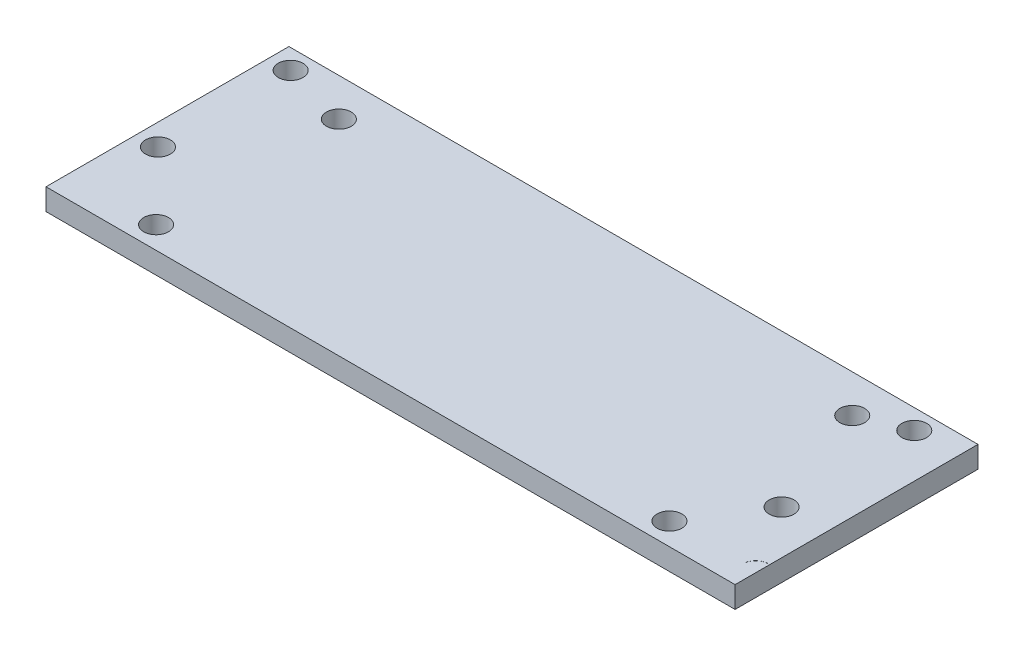
ISO-10303-21;
HEADER;
FILE_DESCRIPTION(('STEP AP214'),'2;1');
FILE_NAME('part.step','',(''),(''),'','','');
FILE_SCHEMA(('AUTOMOTIVE_DESIGN { 1 0 10303 214 1 1 1 1 }'));
ENDSEC;
DATA;
#1=APPLICATION_CONTEXT('core data for automotive mechanical design processes');
#2=APPLICATION_PROTOCOL_DEFINITION('international standard','automotive_design',2000,#1);
#3=PRODUCT_CONTEXT('',#1,'mechanical');
#4=PRODUCT('Part','Part','',(#3));
#5=PRODUCT_RELATED_PRODUCT_CATEGORY('part','',(#4));
#6=PRODUCT_DEFINITION_FORMATION('','',#4);
#7=PRODUCT_DEFINITION_CONTEXT('part definition',#1,'design');
#8=PRODUCT_DEFINITION('design','',#6,#7);
#9=PRODUCT_DEFINITION_SHAPE('','',#8);
#10=(LENGTH_UNIT() NAMED_UNIT(*) SI_UNIT(.MILLI.,.METRE.));
#11=(NAMED_UNIT(*) PLANE_ANGLE_UNIT() SI_UNIT($,.RADIAN.));
#12=(NAMED_UNIT(*) SI_UNIT($,.STERADIAN.) SOLID_ANGLE_UNIT());
#13=UNCERTAINTY_MEASURE_WITH_UNIT(LENGTH_MEASURE(1.E-05),#10,'distance_accuracy_value','');
#14=(GEOMETRIC_REPRESENTATION_CONTEXT(3) GLOBAL_UNCERTAINTY_ASSIGNED_CONTEXT((#13)) GLOBAL_UNIT_ASSIGNED_CONTEXT((#10,
#11,#12)) REPRESENTATION_CONTEXT('',''));
#15=CARTESIAN_POINT('',(0.,0.,0.));
#16=DIRECTION('',(0.,0.,1.));
#17=DIRECTION('',(1.,0.,0.));
#18=AXIS2_PLACEMENT_3D('',#15,#16,#17);
#19=CARTESIAN_POINT('',(-57.15,3.175,17.907));
#20=DIRECTION('',(1.,0.,0.));
#21=DIRECTION('',(0.,0.,-1.));
#22=AXIS2_PLACEMENT_3D('',#19,#20,#21);
#23=PLANE('',#22);
#24=DIRECTION('',(0.,0.,1.));
#25=VECTOR('',#24,1.);
#26=CARTESIAN_POINT('',(-57.15,0.,17.907));
#27=LINE('',#26,#25);
#28=CARTESIAN_POINT('',(-57.15,0.,-17.907));
#29=VERTEX_POINT('',#28);
#30=CARTESIAN_POINT('',(-57.15,0.,17.907));
#31=VERTEX_POINT('',#30);
#32=EDGE_CURVE('E152',#29,#31,#27,.T.);
#33=ORIENTED_EDGE('',*,*,#32,.T.);
#34=DIRECTION('',(0.,-1.,0.));
#35=VECTOR('',#34,1.);
#36=CARTESIAN_POINT('',(-57.15,3.175,17.907));
#37=LINE('',#36,#35);
#38=CARTESIAN_POINT('',(-57.15,3.175,17.907));
#39=VERTEX_POINT('',#38);
#40=EDGE_CURVE('E44',#39,#31,#37,.T.);
#41=ORIENTED_EDGE('',*,*,#40,.F.);
#42=DIRECTION('',(0.,0.,1.));
#43=VECTOR('',#42,1.);
#44=CARTESIAN_POINT('',(-57.15,3.175,17.907));
#45=LINE('',#44,#43);
#46=CARTESIAN_POINT('',(-57.15,3.175,-17.907));
#47=VERTEX_POINT('',#46);
#48=EDGE_CURVE('E155',#47,#39,#45,.T.);
#49=ORIENTED_EDGE('',*,*,#48,.F.);
#50=DIRECTION('',(0.,-1.,0.));
#51=VECTOR('',#50,1.);
#52=CARTESIAN_POINT('',(-57.15,3.175,-17.907));
#53=LINE('',#52,#51);
#54=EDGE_CURVE('E164',#47,#29,#53,.T.);
#55=ORIENTED_EDGE('',*,*,#54,.T.);
#56=EDGE_LOOP('',(#33,#41,#49,#55));
#57=FACE_BOUND('',#56,.T.);
#58=ADVANCED_FACE('F37',(#57),#23,.F.);
#59=CARTESIAN_POINT('',(57.15,3.175,17.907));
#60=DIRECTION('',(0.,0.,-1.));
#61=DIRECTION('',(-1.,0.,0.));
#62=AXIS2_PLACEMENT_3D('',#59,#60,#61);
#63=PLANE('',#62);
#64=DIRECTION('',(1.,0.,0.));
#65=VECTOR('',#64,1.);
#66=CARTESIAN_POINT('',(57.15,0.,17.907));
#67=LINE('',#66,#65);
#68=CARTESIAN_POINT('',(44.45,0.,17.907));
#69=VERTEX_POINT('',#68);
#70=EDGE_CURVE('E167',#31,#69,#67,.T.);
#71=ORIENTED_EDGE('',*,*,#70,.T.);
#72=DIRECTION('',(0.,1.,0.));
#73=VECTOR('',#72,1.);
#74=CARTESIAN_POINT('',(44.45,0.,17.907));
#75=LINE('',#74,#73);
#76=CARTESIAN_POINT('',(44.45,3.175,17.907));
#77=VERTEX_POINT('',#76);
#78=EDGE_CURVE('E90',#69,#77,#75,.T.);
#79=ORIENTED_EDGE('',*,*,#78,.T.);
#80=DIRECTION('',(1.,0.,0.));
#81=VECTOR('',#80,1.);
#82=CARTESIAN_POINT('',(57.15,3.175,17.907));
#83=LINE('',#82,#81);
#84=EDGE_CURVE('E158',#39,#77,#83,.T.);
#85=ORIENTED_EDGE('',*,*,#84,.F.);
#86=ORIENTED_EDGE('',*,*,#40,.T.);
#87=EDGE_LOOP('',(#71,#79,#85,#86));
#88=FACE_BOUND('',#87,.T.);
#89=ADVANCED_FACE('F175',(#88),#63,.F.);
#90=CARTESIAN_POINT('',(57.15,3.175,-17.907));
#91=DIRECTION('',(0.,0.,1.));
#92=DIRECTION('',(1.,0.,0.));
#93=AXIS2_PLACEMENT_3D('',#90,#91,#92);
#94=PLANE('',#93);
#95=DIRECTION('',(-1.,0.,0.));
#96=VECTOR('',#95,1.);
#97=CARTESIAN_POINT('',(57.15,3.175,-17.907));
#98=LINE('',#97,#96);
#99=CARTESIAN_POINT('',(44.45,3.175,-17.907));
#100=VERTEX_POINT('',#99);
#101=EDGE_CURVE('E162',#100,#47,#98,.T.);
#102=ORIENTED_EDGE('',*,*,#101,.F.);
#103=DIRECTION('',(0.,1.,0.));
#104=VECTOR('',#103,1.);
#105=CARTESIAN_POINT('',(44.45,0.,-17.907));
#106=LINE('',#105,#104);
#107=CARTESIAN_POINT('',(44.45,0.,-17.907));
#108=VERTEX_POINT('',#107);
#109=EDGE_CURVE('E123',#108,#100,#106,.T.);
#110=ORIENTED_EDGE('',*,*,#109,.F.);
#111=DIRECTION('',(-1.,0.,0.));
#112=VECTOR('',#111,1.);
#113=CARTESIAN_POINT('',(57.15,0.,-17.907));
#114=LINE('',#113,#112);
#115=EDGE_CURVE('E159',#108,#29,#114,.T.);
#116=ORIENTED_EDGE('',*,*,#115,.T.);
#117=ORIENTED_EDGE('',*,*,#54,.F.);
#118=EDGE_LOOP('',(#102,#110,#116,#117));
#119=FACE_BOUND('',#118,.T.);
#120=ADVANCED_FACE('F191',(#119),#94,.F.);
#121=CARTESIAN_POINT('',(0.,3.175,0.));
#122=DIRECTION('',(0.,1.,0.));
#123=DIRECTION('',(0.,0.,1.));
#124=AXIS2_PLACEMENT_3D('',#121,#122,#123);
#125=PLANE('',#124);
#126=CARTESIAN_POINT('',(37.973,3.175,-14.986));
#127=DIRECTION('',(0.,1.,0.));
#128=DIRECTION('',(0.,0.,1.));
#129=AXIS2_PLACEMENT_3D('',#126,#127,#128);
#130=CIRCLE('',#129,1.8288);
#131=CARTESIAN_POINT('',(37.973,3.175,-13.1572));
#132=VERTEX_POINT('',#131);
#133=EDGE_CURVE('E401',#132,#132,#130,.T.);
#134=ORIENTED_EDGE('',*,*,#133,.F.);
#135=EDGE_LOOP('',(#134));
#136=FACE_BOUND('',#135,.T.);
#137=CARTESIAN_POINT('',(37.973,3.175,4.57200000000001));
#138=DIRECTION('',(0.,1.,0.));
#139=DIRECTION('',(0.,0.,1.));
#140=AXIS2_PLACEMENT_3D('',#137,#138,#139);
#141=CIRCLE('',#140,1.8288);
#142=CARTESIAN_POINT('',(37.973,3.175,6.40080000000001));
#143=VERTEX_POINT('',#142);
#144=EDGE_CURVE('E105',#143,#143,#141,.T.);
#145=ORIENTED_EDGE('',*,*,#144,.F.);
#146=EDGE_LOOP('',(#145));
#147=FACE_BOUND('',#146,.T.);
#148=DIRECTION('',(0.,0.,1.));
#149=VECTOR('',#148,1.);
#150=CARTESIAN_POINT('',(44.45,3.175,17.907));
#151=LINE('',#150,#149);
#152=EDGE_CURVE('E118',#100,#77,#151,.T.);
#153=ORIENTED_EDGE('',*,*,#152,.F.);
#154=ORIENTED_EDGE('',*,*,#101,.T.);
#155=ORIENTED_EDGE('',*,*,#48,.T.);
#156=ORIENTED_EDGE('',*,*,#84,.T.);
#157=EDGE_LOOP('',(#153,#154,#155,#156));
#158=FACE_BOUND('',#157,.T.);
#159=CARTESIAN_POINT('',(44.196,3.175,14.6304));
#160=DIRECTION('',(0.,1.,0.));
#161=DIRECTION('',(0.,0.,-1.));
#162=AXIS2_PLACEMENT_3D('',#159,#160,#161);
#163=CIRCLE('',#162,1.8288);
#164=CARTESIAN_POINT('',(44.196,3.175,12.8016));
#165=VERTEX_POINT('',#164);
#166=CARTESIAN_POINT('',(42.3672,3.175,14.6304000000004));
#167=VERTEX_POINT('',#166);
#168=EDGE_CURVE('E85',#165,#167,#163,.T.);
#169=ORIENTED_EDGE('',*,*,#168,.F.);
#170=CARTESIAN_POINT('',(44.2595,3.175,14.6939));
#171=DIRECTION('',(0.,1.,0.));
#172=DIRECTION('',(0.,0.,-1.));
#173=AXIS2_PLACEMENT_3D('',#170,#171,#172);
#174=CIRCLE('',#173,1.89336513646997);
#175=EDGE_CURVE('E89',#165,#167,#174,.T.);
#176=ORIENTED_EDGE('',*,*,#175,.T.);
#177=EDGE_LOOP('',(#169,#176));
#178=FACE_BOUND('',#177,.T.);
#179=CARTESIAN_POINT('',(31.496,3.175,-12.319));
#180=DIRECTION('',(0.,1.,0.));
#181=DIRECTION('',(0.,0.,-1.));
#182=AXIS2_PLACEMENT_3D('',#179,#180,#181);
#183=CIRCLE('',#182,1.8288);
#184=CARTESIAN_POINT('',(31.496,3.175,-14.1478));
#185=VERTEX_POINT('',#184);
#186=EDGE_CURVE('E97',#185,#185,#183,.T.);
#187=ORIENTED_EDGE('',*,*,#186,.F.);
#188=EDGE_LOOP('',(#187));
#189=FACE_BOUND('',#188,.T.);
#190=CARTESIAN_POINT('',(31.496,3.175,14.6304));
#191=DIRECTION('',(0.,1.,0.));
#192=DIRECTION('',(0.,0.,-1.));
#193=AXIS2_PLACEMENT_3D('',#190,#191,#192);
#194=CIRCLE('',#193,1.8288);
#195=CARTESIAN_POINT('',(31.496,3.175,12.8016));
#196=VERTEX_POINT('',#195);
#197=EDGE_CURVE('E112',#196,#196,#194,.T.);
#198=ORIENTED_EDGE('',*,*,#197,.F.);
#199=EDGE_LOOP('',(#198));
#200=FACE_BOUND('',#199,.T.);
#201=CARTESIAN_POINT('',(-44.196,3.175,14.6304));
#202=DIRECTION('',(0.,1.,0.));
#203=DIRECTION('',(0.,0.,1.));
#204=AXIS2_PLACEMENT_3D('',#201,#202,#203);
#205=CIRCLE('',#204,1.8288);
#206=CARTESIAN_POINT('',(-44.196,3.175,16.4592));
#207=VERTEX_POINT('',#206);
#208=EDGE_CURVE('E129',#207,#207,#205,.T.);
#209=ORIENTED_EDGE('',*,*,#208,.F.);
#210=EDGE_LOOP('',(#209));
#211=FACE_BOUND('',#210,.T.);
#212=CARTESIAN_POINT('',(-44.196,3.175,-12.319));
#213=DIRECTION('',(0.,1.,0.));
#214=DIRECTION('',(0.,0.,1.));
#215=AXIS2_PLACEMENT_3D('',#212,#213,#214);
#216=CIRCLE('',#215,1.8288);
#217=CARTESIAN_POINT('',(-44.196,3.175,-10.4902));
#218=VERTEX_POINT('',#217);
#219=EDGE_CURVE('E134',#218,#218,#216,.T.);
#220=ORIENTED_EDGE('',*,*,#219,.F.);
#221=EDGE_LOOP('',(#220));
#222=FACE_BOUND('',#221,.T.);
#223=CARTESIAN_POINT('',(-53.975,3.175,4.57200000000001));
#224=DIRECTION('',(0.,1.,0.));
#225=DIRECTION('',(0.,0.,1.));
#226=AXIS2_PLACEMENT_3D('',#223,#224,#225);
#227=CIRCLE('',#226,1.8288);
#228=CARTESIAN_POINT('',(-53.975,3.175,6.40080000000001));
#229=VERTEX_POINT('',#228);
#230=EDGE_CURVE('E140',#229,#229,#227,.T.);
#231=ORIENTED_EDGE('',*,*,#230,.F.);
#232=EDGE_LOOP('',(#231));
#233=FACE_BOUND('',#232,.T.);
#234=CARTESIAN_POINT('',(-53.975,3.175,-14.986));
#235=DIRECTION('',(0.,1.,0.));
#236=DIRECTION('',(0.,0.,1.));
#237=AXIS2_PLACEMENT_3D('',#234,#235,#236);
#238=CIRCLE('',#237,1.8288);
#239=CARTESIAN_POINT('',(-53.975,3.175,-13.1572));
#240=VERTEX_POINT('',#239);
#241=EDGE_CURVE('E146',#240,#240,#238,.T.);
#242=ORIENTED_EDGE('',*,*,#241,.F.);
#243=EDGE_LOOP('',(#242));
#244=FACE_BOUND('',#243,.T.);
#245=ADVANCED_FACE('F86',(#136,#147,#158,#178,#189,#200,#211,#222,#233,#244),#125,.T.);
#246=CARTESIAN_POINT('',(0.,0.,0.));
#247=DIRECTION('',(0.,1.,0.));
#248=DIRECTION('',(0.,0.,1.));
#249=AXIS2_PLACEMENT_3D('',#246,#247,#248);
#250=PLANE('',#249);
#251=CARTESIAN_POINT('',(44.2595,0.,14.6939));
#252=DIRECTION('',(0.,1.,0.));
#253=DIRECTION('',(0.,0.,-1.));
#254=AXIS2_PLACEMENT_3D('',#251,#252,#253);
#255=CIRCLE('',#254,1.89336513646997);
#256=CARTESIAN_POINT('',(44.196,0.,12.8016));
#257=VERTEX_POINT('',#256);
#258=CARTESIAN_POINT('',(42.3672,0.,14.6304000000004));
#259=VERTEX_POINT('',#258);
#260=EDGE_CURVE('E98',#257,#259,#255,.T.);
#261=ORIENTED_EDGE('',*,*,#260,.F.);
#262=CARTESIAN_POINT('',(44.196,0.,14.6304));
#263=DIRECTION('',(0.,1.,0.));
#264=DIRECTION('',(0.,0.,-1.));
#265=AXIS2_PLACEMENT_3D('',#262,#263,#264);
#266=CIRCLE('',#265,1.8288);
#267=EDGE_CURVE('E53',#257,#259,#266,.T.);
#268=ORIENTED_EDGE('',*,*,#267,.T.);
#269=EDGE_LOOP('',(#261,#268));
#270=FACE_BOUND('',#269,.T.);
#271=CARTESIAN_POINT('',(37.973,0.,-14.986));
#272=DIRECTION('',(0.,1.,0.));
#273=DIRECTION('',(0.,0.,1.));
#274=AXIS2_PLACEMENT_3D('',#271,#272,#273);
#275=CIRCLE('',#274,1.8288);
#276=CARTESIAN_POINT('',(37.973,0.,-13.1572));
#277=VERTEX_POINT('',#276);
#278=EDGE_CURVE('E398',#277,#277,#275,.T.);
#279=ORIENTED_EDGE('',*,*,#278,.T.);
#280=EDGE_LOOP('',(#279));
#281=FACE_BOUND('',#280,.T.);
#282=CARTESIAN_POINT('',(31.496,0.,-12.319));
#283=DIRECTION('',(0.,1.,0.));
#284=DIRECTION('',(0.,0.,-1.));
#285=AXIS2_PLACEMENT_3D('',#282,#283,#284);
#286=CIRCLE('',#285,1.8288);
#287=CARTESIAN_POINT('',(31.496,0.,-14.1478));
#288=VERTEX_POINT('',#287);
#289=EDGE_CURVE('E109',#288,#288,#286,.T.);
#290=ORIENTED_EDGE('',*,*,#289,.T.);
#291=EDGE_LOOP('',(#290));
#292=FACE_BOUND('',#291,.T.);
#293=CARTESIAN_POINT('',(37.973,0.,4.57200000000001));
#294=DIRECTION('',(0.,1.,0.));
#295=DIRECTION('',(0.,0.,1.));
#296=AXIS2_PLACEMENT_3D('',#293,#294,#295);
#297=CIRCLE('',#296,1.8288);
#298=CARTESIAN_POINT('',(37.973,0.,6.40080000000001));
#299=VERTEX_POINT('',#298);
#300=EDGE_CURVE('E101',#299,#299,#297,.T.);
#301=ORIENTED_EDGE('',*,*,#300,.T.);
#302=EDGE_LOOP('',(#301));
#303=FACE_BOUND('',#302,.T.);
#304=CARTESIAN_POINT('',(31.496,0.,14.6304));
#305=DIRECTION('',(0.,1.,0.));
#306=DIRECTION('',(0.,0.,-1.));
#307=AXIS2_PLACEMENT_3D('',#304,#305,#306);
#308=CIRCLE('',#307,1.8288);
#309=CARTESIAN_POINT('',(31.496,0.,12.8016));
#310=VERTEX_POINT('',#309);
#311=EDGE_CURVE('E115',#310,#310,#308,.T.);
#312=ORIENTED_EDGE('',*,*,#311,.T.);
#313=EDGE_LOOP('',(#312));
#314=FACE_BOUND('',#313,.T.);
#315=ORIENTED_EDGE('',*,*,#115,.F.);
#316=DIRECTION('',(0.,0.,1.));
#317=VECTOR('',#316,1.);
#318=CARTESIAN_POINT('',(44.45,0.,17.907));
#319=LINE('',#318,#317);
#320=EDGE_CURVE('E121',#108,#69,#319,.T.);
#321=ORIENTED_EDGE('',*,*,#320,.T.);
#322=ORIENTED_EDGE('',*,*,#70,.F.);
#323=ORIENTED_EDGE('',*,*,#32,.F.);
#324=EDGE_LOOP('',(#315,#321,#322,#323));
#325=FACE_BOUND('',#324,.T.);
#326=CARTESIAN_POINT('',(-44.196,0.,14.6304));
#327=DIRECTION('',(0.,1.,0.));
#328=DIRECTION('',(0.,0.,1.));
#329=AXIS2_PLACEMENT_3D('',#326,#327,#328);
#330=CIRCLE('',#329,1.8288);
#331=CARTESIAN_POINT('',(-44.196,0.,16.4592));
#332=VERTEX_POINT('',#331);
#333=EDGE_CURVE('E131',#332,#332,#330,.T.);
#334=ORIENTED_EDGE('',*,*,#333,.T.);
#335=EDGE_LOOP('',(#334));
#336=FACE_BOUND('',#335,.T.);
#337=CARTESIAN_POINT('',(-44.196,0.,-12.319));
#338=DIRECTION('',(0.,1.,0.));
#339=DIRECTION('',(0.,0.,1.));
#340=AXIS2_PLACEMENT_3D('',#337,#338,#339);
#341=CIRCLE('',#340,1.8288);
#342=CARTESIAN_POINT('',(-44.196,0.,-10.4902));
#343=VERTEX_POINT('',#342);
#344=EDGE_CURVE('E137',#343,#343,#341,.T.);
#345=ORIENTED_EDGE('',*,*,#344,.T.);
#346=EDGE_LOOP('',(#345));
#347=FACE_BOUND('',#346,.T.);
#348=CARTESIAN_POINT('',(-53.975,0.,4.57200000000001));
#349=DIRECTION('',(0.,1.,0.));
#350=DIRECTION('',(0.,0.,1.));
#351=AXIS2_PLACEMENT_3D('',#348,#349,#350);
#352=CIRCLE('',#351,1.8288);
#353=CARTESIAN_POINT('',(-53.975,0.,6.40080000000001));
#354=VERTEX_POINT('',#353);
#355=EDGE_CURVE('E143',#354,#354,#352,.T.);
#356=ORIENTED_EDGE('',*,*,#355,.T.);
#357=EDGE_LOOP('',(#356));
#358=FACE_BOUND('',#357,.T.);
#359=CARTESIAN_POINT('',(-53.975,0.,-14.986));
#360=DIRECTION('',(0.,1.,0.));
#361=DIRECTION('',(0.,0.,1.));
#362=AXIS2_PLACEMENT_3D('',#359,#360,#361);
#363=CIRCLE('',#362,1.8288);
#364=CARTESIAN_POINT('',(-53.975,0.,-13.1572));
#365=VERTEX_POINT('',#364);
#366=EDGE_CURVE('E149',#365,#365,#363,.T.);
#367=ORIENTED_EDGE('',*,*,#366,.T.);
#368=EDGE_LOOP('',(#367));
#369=FACE_BOUND('',#368,.T.);
#370=ADVANCED_FACE('F182',(#270,#281,#292,#303,#314,#325,#336,#347,#358,#369),#250,.F.);
#371=CARTESIAN_POINT('',(-53.975,0.,-14.986));
#372=DIRECTION('',(0.,1.,0.));
#373=DIRECTION('',(0.,0.,1.));
#374=AXIS2_PLACEMENT_3D('',#371,#372,#373);
#375=CYLINDRICAL_SURFACE('',#374,1.8288);
#376=ORIENTED_EDGE('',*,*,#366,.F.);
#377=EDGE_LOOP('',(#376));
#378=FACE_BOUND('',#377,.T.);
#379=ORIENTED_EDGE('',*,*,#241,.T.);
#380=EDGE_LOOP('',(#379));
#381=FACE_BOUND('',#380,.T.);
#382=ADVANCED_FACE('F287',(#378,#381),#375,.F.);
#383=CARTESIAN_POINT('',(-53.975,0.,4.57200000000001));
#384=DIRECTION('',(0.,1.,0.));
#385=DIRECTION('',(0.,0.,1.));
#386=AXIS2_PLACEMENT_3D('',#383,#384,#385);
#387=CYLINDRICAL_SURFACE('',#386,1.8288);
#388=ORIENTED_EDGE('',*,*,#355,.F.);
#389=EDGE_LOOP('',(#388));
#390=FACE_BOUND('',#389,.T.);
#391=ORIENTED_EDGE('',*,*,#230,.T.);
#392=EDGE_LOOP('',(#391));
#393=FACE_BOUND('',#392,.T.);
#394=ADVANCED_FACE('F349',(#390,#393),#387,.F.);
#395=CARTESIAN_POINT('',(-44.196,0.,-12.319));
#396=DIRECTION('',(0.,1.,0.));
#397=DIRECTION('',(0.,0.,1.));
#398=AXIS2_PLACEMENT_3D('',#395,#396,#397);
#399=CYLINDRICAL_SURFACE('',#398,1.8288);
#400=ORIENTED_EDGE('',*,*,#344,.F.);
#401=EDGE_LOOP('',(#400));
#402=FACE_BOUND('',#401,.T.);
#403=ORIENTED_EDGE('',*,*,#219,.T.);
#404=EDGE_LOOP('',(#403));
#405=FACE_BOUND('',#404,.T.);
#406=ADVANCED_FACE('F358',(#402,#405),#399,.F.);
#407=CARTESIAN_POINT('',(-44.196,0.,14.6304));
#408=DIRECTION('',(0.,1.,0.));
#409=DIRECTION('',(0.,0.,1.));
#410=AXIS2_PLACEMENT_3D('',#407,#408,#409);
#411=CYLINDRICAL_SURFACE('',#410,1.8288);
#412=ORIENTED_EDGE('',*,*,#333,.F.);
#413=EDGE_LOOP('',(#412));
#414=FACE_BOUND('',#413,.T.);
#415=ORIENTED_EDGE('',*,*,#208,.T.);
#416=EDGE_LOOP('',(#415));
#417=FACE_BOUND('',#416,.T.);
#418=ADVANCED_FACE('F215',(#414,#417),#411,.F.);
#419=CARTESIAN_POINT('',(44.196,0.,14.6304));
#420=DIRECTION('',(0.,1.,0.));
#421=DIRECTION('',(0.,0.,1.));
#422=AXIS2_PLACEMENT_3D('',#419,#420,#421);
#423=CYLINDRICAL_SURFACE('',#422,1.8288);
#424=ORIENTED_EDGE('',*,*,#168,.T.);
#425=DIRECTION('',(0.,1.,0.));
#426=VECTOR('',#425,1.);
#427=CARTESIAN_POINT('',(42.3672,1.5875,14.6304000000004));
#428=LINE('',#427,#426);
#429=EDGE_CURVE('E11',#167,#259,#428,.F.);
#430=ORIENTED_EDGE('',*,*,#429,.T.);
#431=ORIENTED_EDGE('',*,*,#267,.F.);
#432=DIRECTION('',(0.,1.,0.));
#433=VECTOR('',#432,1.);
#434=CARTESIAN_POINT('',(44.196,0.,12.8016));
#435=LINE('',#434,#433);
#436=EDGE_CURVE('E92',#257,#165,#435,.T.);
#437=ORIENTED_EDGE('',*,*,#436,.T.);
#438=EDGE_LOOP('',(#424,#430,#431,#437));
#439=FACE_BOUND('',#438,.T.);
#440=ADVANCED_FACE('F93',(#439),#423,.F.);
#441=CARTESIAN_POINT('',(44.45,0.,17.907));
#442=DIRECTION('',(-1.,0.,0.));
#443=DIRECTION('',(0.,0.,1.));
#444=AXIS2_PLACEMENT_3D('',#441,#442,#443);
#445=PLANE('',#444);
#446=ORIENTED_EDGE('',*,*,#78,.F.);
#447=ORIENTED_EDGE('',*,*,#320,.F.);
#448=ORIENTED_EDGE('',*,*,#109,.T.);
#449=ORIENTED_EDGE('',*,*,#152,.T.);
#450=EDGE_LOOP('',(#446,#447,#448,#449));
#451=FACE_BOUND('',#450,.T.);
#452=ADVANCED_FACE('F187',(#451),#445,.F.);
#453=CARTESIAN_POINT('',(31.496,0.,14.6304));
#454=DIRECTION('',(0.,1.,0.));
#455=DIRECTION('',(0.,0.,1.));
#456=AXIS2_PLACEMENT_3D('',#453,#454,#455);
#457=CYLINDRICAL_SURFACE('',#456,1.8288);
#458=ORIENTED_EDGE('',*,*,#311,.F.);
#459=EDGE_LOOP('',(#458));
#460=FACE_BOUND('',#459,.T.);
#461=ORIENTED_EDGE('',*,*,#197,.T.);
#462=EDGE_LOOP('',(#461));
#463=FACE_BOUND('',#462,.T.);
#464=ADVANCED_FACE('F225',(#460,#463),#457,.F.);
#465=CARTESIAN_POINT('',(31.496,0.,-12.319));
#466=DIRECTION('',(0.,1.,0.));
#467=DIRECTION('',(0.,0.,1.));
#468=AXIS2_PLACEMENT_3D('',#465,#466,#467);
#469=CYLINDRICAL_SURFACE('',#468,1.8288);
#470=ORIENTED_EDGE('',*,*,#289,.F.);
#471=EDGE_LOOP('',(#470));
#472=FACE_BOUND('',#471,.T.);
#473=ORIENTED_EDGE('',*,*,#186,.T.);
#474=EDGE_LOOP('',(#473));
#475=FACE_BOUND('',#474,.T.);
#476=ADVANCED_FACE('F230',(#472,#475),#469,.F.);
#477=CARTESIAN_POINT('',(44.2595,0.,14.6939));
#478=DIRECTION('',(0.,1.,0.));
#479=DIRECTION('',(0.,0.,1.));
#480=AXIS2_PLACEMENT_3D('',#477,#478,#479);
#481=CYLINDRICAL_SURFACE('',#480,1.89336513646997);
#482=ORIENTED_EDGE('',*,*,#429,.F.);
#483=ORIENTED_EDGE('',*,*,#175,.F.);
#484=ORIENTED_EDGE('',*,*,#436,.F.);
#485=ORIENTED_EDGE('',*,*,#260,.T.);
#486=EDGE_LOOP('',(#482,#483,#484,#485));
#487=FACE_BOUND('',#486,.T.);
#488=ADVANCED_FACE('F100',(#487),#481,.T.);
#489=CARTESIAN_POINT('',(37.973,0.,4.57200000000001));
#490=DIRECTION('',(0.,1.,0.));
#491=DIRECTION('',(0.,0.,1.));
#492=AXIS2_PLACEMENT_3D('',#489,#490,#491);
#493=CYLINDRICAL_SURFACE('',#492,1.8288);
#494=ORIENTED_EDGE('',*,*,#300,.F.);
#495=EDGE_LOOP('',(#494));
#496=FACE_BOUND('',#495,.T.);
#497=ORIENTED_EDGE('',*,*,#144,.T.);
#498=EDGE_LOOP('',(#497));
#499=FACE_BOUND('',#498,.T.);
#500=ADVANCED_FACE('F268',(#496,#499),#493,.F.);
#501=CARTESIAN_POINT('',(37.973,0.,-14.986));
#502=DIRECTION('',(0.,1.,0.));
#503=DIRECTION('',(0.,0.,1.));
#504=AXIS2_PLACEMENT_3D('',#501,#502,#503);
#505=CYLINDRICAL_SURFACE('',#504,1.8288);
#506=ORIENTED_EDGE('',*,*,#278,.F.);
#507=EDGE_LOOP('',(#506));
#508=FACE_BOUND('',#507,.T.);
#509=ORIENTED_EDGE('',*,*,#133,.T.);
#510=EDGE_LOOP('',(#509));
#511=FACE_BOUND('',#510,.T.);
#512=ADVANCED_FACE('F296',(#508,#511),#505,.F.);
#513=CLOSED_SHELL('',(#58,#89,#120,#245,#370,#382,#394,#406,#418,#440,#452,#464,#476,#488,#500,#512));
#514=MANIFOLD_SOLID_BREP('B2',#513);
#515=ADVANCED_BREP_SHAPE_REPRESENTATION('',(#18,#514),#14);
#516=SHAPE_DEFINITION_REPRESENTATION(#9,#515);
ENDSEC;
END-ISO-10303-21;
